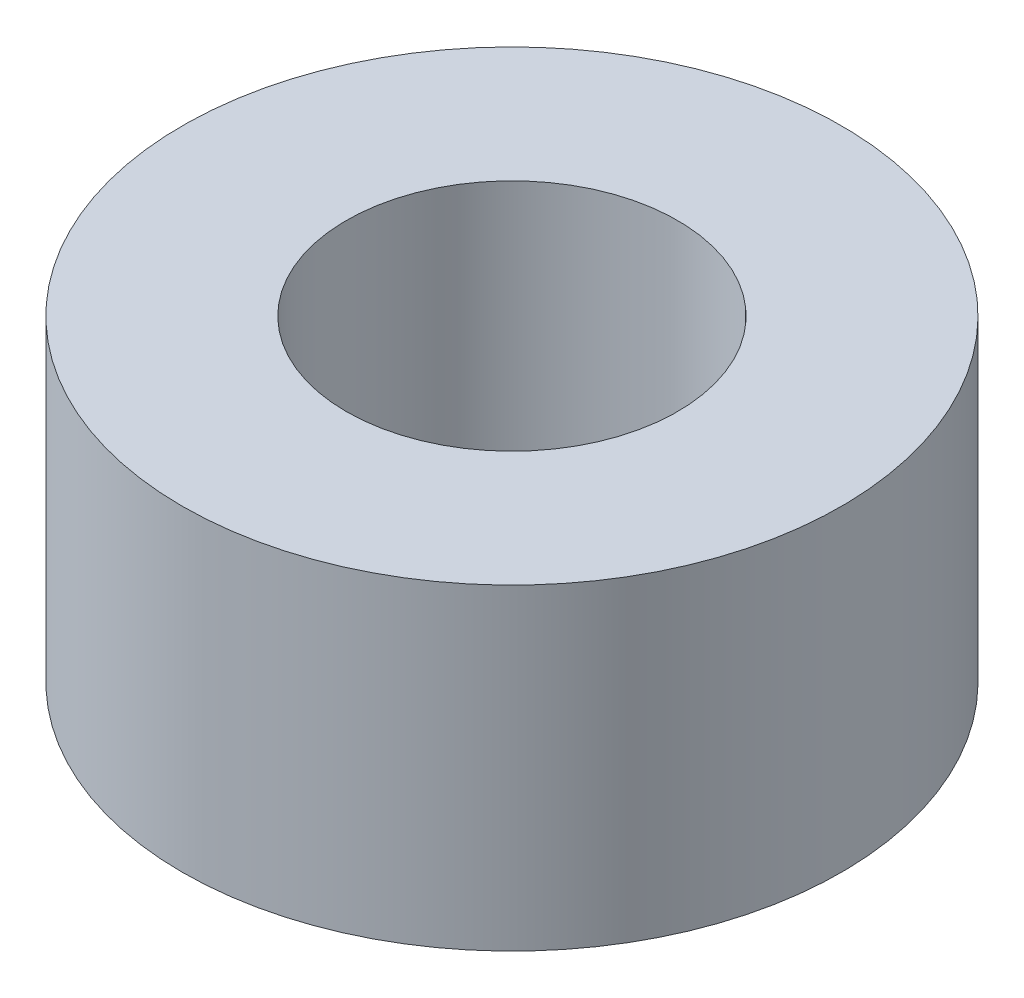
ISO-10303-21;
HEADER;
FILE_DESCRIPTION(('STEP AP214'),'2;1');
FILE_NAME('part.step','',(''),(''),'','','');
FILE_SCHEMA(('AUTOMOTIVE_DESIGN { 1 0 10303 214 1 1 1 1 }'));
ENDSEC;
DATA;
#1=APPLICATION_CONTEXT('core data for automotive mechanical design processes');
#2=APPLICATION_PROTOCOL_DEFINITION('international standard','automotive_design',2000,#1);
#3=PRODUCT_CONTEXT('',#1,'mechanical');
#4=PRODUCT('Part','Part','',(#3));
#5=PRODUCT_RELATED_PRODUCT_CATEGORY('part','',(#4));
#6=PRODUCT_DEFINITION_FORMATION('','',#4);
#7=PRODUCT_DEFINITION_CONTEXT('part definition',#1,'design');
#8=PRODUCT_DEFINITION('design','',#6,#7);
#9=PRODUCT_DEFINITION_SHAPE('','',#8);
#10=(LENGTH_UNIT() NAMED_UNIT(*) SI_UNIT(.MILLI.,.METRE.));
#11=(NAMED_UNIT(*) PLANE_ANGLE_UNIT() SI_UNIT($,.RADIAN.));
#12=(NAMED_UNIT(*) SI_UNIT($,.STERADIAN.) SOLID_ANGLE_UNIT());
#13=UNCERTAINTY_MEASURE_WITH_UNIT(LENGTH_MEASURE(1.E-05),#10,'distance_accuracy_value','');
#14=(GEOMETRIC_REPRESENTATION_CONTEXT(3) GLOBAL_UNCERTAINTY_ASSIGNED_CONTEXT((#13)) GLOBAL_UNIT_ASSIGNED_CONTEXT((#10,
#11,#12)) REPRESENTATION_CONTEXT('',''));
#15=CARTESIAN_POINT('',(0.,0.,0.));
#16=DIRECTION('',(0.,0.,1.));
#17=DIRECTION('',(1.,0.,0.));
#18=AXIS2_PLACEMENT_3D('',#15,#16,#17);
#19=CARTESIAN_POINT('',(0.,2.9,0.));
#20=DIRECTION('',(0.,1.,0.));
#21=DIRECTION('',(0.,0.,1.));
#22=AXIS2_PLACEMENT_3D('',#19,#20,#21);
#23=PLANE('',#22);
#24=CARTESIAN_POINT('',(0.,2.9,0.));
#25=DIRECTION('',(0.,1.,0.));
#26=DIRECTION('',(0.,0.,1.));
#27=AXIS2_PLACEMENT_3D('',#24,#25,#26);
#28=CIRCLE('',#27,3.015);
#29=CARTESIAN_POINT('',(0.,2.9,3.015));
#30=VERTEX_POINT('',#29);
#31=EDGE_CURVE('E10',#30,#30,#28,.T.);
#32=ORIENTED_EDGE('',*,*,#31,.T.);
#33=EDGE_LOOP('',(#32));
#34=FACE_BOUND('',#33,.T.);
#35=CARTESIAN_POINT('',(0.,2.9,0.));
#36=DIRECTION('',(0.,1.,0.));
#37=DIRECTION('',(0.,0.,1.));
#38=AXIS2_PLACEMENT_3D('',#35,#36,#37);
#39=CIRCLE('',#38,1.515);
#40=CARTESIAN_POINT('',(0.,2.9,1.515));
#41=VERTEX_POINT('',#40);
#42=EDGE_CURVE('E50',#41,#41,#39,.T.);
#43=ORIENTED_EDGE('',*,*,#42,.F.);
#44=EDGE_LOOP('',(#43));
#45=FACE_BOUND('',#44,.T.);
#46=ADVANCED_FACE('F37',(#34,#45),#23,.T.);
#47=CARTESIAN_POINT('',(0.,0.,0.));
#48=DIRECTION('',(0.,1.,0.));
#49=DIRECTION('',(0.,0.,1.));
#50=AXIS2_PLACEMENT_3D('',#47,#48,#49);
#51=PLANE('',#50);
#52=CARTESIAN_POINT('',(0.,0.,0.));
#53=DIRECTION('',(0.,1.,0.));
#54=DIRECTION('',(0.,0.,1.));
#55=AXIS2_PLACEMENT_3D('',#52,#53,#54);
#56=CIRCLE('',#55,3.015);
#57=CARTESIAN_POINT('',(0.,0.,3.015));
#58=VERTEX_POINT('',#57);
#59=EDGE_CURVE('E41',#58,#58,#56,.T.);
#60=ORIENTED_EDGE('',*,*,#59,.F.);
#61=EDGE_LOOP('',(#60));
#62=FACE_BOUND('',#61,.T.);
#63=CARTESIAN_POINT('',(0.,0.,0.));
#64=DIRECTION('',(0.,1.,0.));
#65=DIRECTION('',(0.,0.,1.));
#66=AXIS2_PLACEMENT_3D('',#63,#64,#65);
#67=CIRCLE('',#66,1.515);
#68=CARTESIAN_POINT('',(0.,0.,1.515));
#69=VERTEX_POINT('',#68);
#70=EDGE_CURVE('E52',#69,#69,#67,.T.);
#71=ORIENTED_EDGE('',*,*,#70,.T.);
#72=EDGE_LOOP('',(#71));
#73=FACE_BOUND('',#72,.T.);
#74=ADVANCED_FACE('F64',(#62,#73),#51,.F.);
#75=CARTESIAN_POINT('',(0.,2.9,0.));
#76=DIRECTION('',(0.,-1.,0.));
#77=DIRECTION('',(0.,0.,-1.));
#78=AXIS2_PLACEMENT_3D('',#75,#76,#77);
#79=CYLINDRICAL_SURFACE('',#78,3.015);
#80=ORIENTED_EDGE('',*,*,#31,.F.);
#81=EDGE_LOOP('',(#80));
#82=FACE_BOUND('',#81,.T.);
#83=ORIENTED_EDGE('',*,*,#59,.T.);
#84=EDGE_LOOP('',(#83));
#85=FACE_BOUND('',#84,.T.);
#86=ADVANCED_FACE('F39',(#82,#85),#79,.T.);
#87=CARTESIAN_POINT('',(0.,2.9,0.));
#88=DIRECTION('',(0.,-1.,0.));
#89=DIRECTION('',(0.,0.,-1.));
#90=AXIS2_PLACEMENT_3D('',#87,#88,#89);
#91=CYLINDRICAL_SURFACE('',#90,1.515);
#92=ORIENTED_EDGE('',*,*,#42,.T.);
#93=EDGE_LOOP('',(#92));
#94=FACE_BOUND('',#93,.T.);
#95=ORIENTED_EDGE('',*,*,#70,.F.);
#96=EDGE_LOOP('',(#95));
#97=FACE_BOUND('',#96,.T.);
#98=ADVANCED_FACE('F60',(#94,#97),#91,.F.);
#99=CLOSED_SHELL('',(#46,#74,#86,#98));
#100=MANIFOLD_SOLID_BREP('B2',#99);
#101=ADVANCED_BREP_SHAPE_REPRESENTATION('',(#18,#100),#14);
#102=SHAPE_DEFINITION_REPRESENTATION(#9,#101);
ENDSEC;
END-ISO-10303-21;
